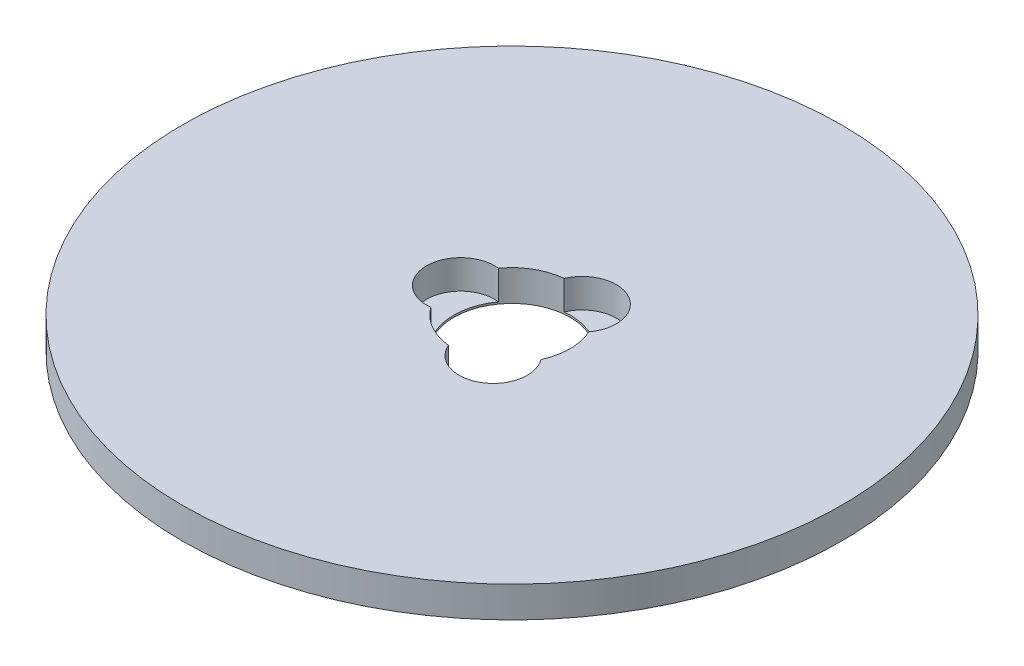
ISO-10303-21;
HEADER;
FILE_DESCRIPTION(('STEP AP214'),'2;1');
FILE_NAME('part.step','',(''),(''),'','','');
FILE_SCHEMA(('AUTOMOTIVE_DESIGN { 1 0 10303 214 1 1 1 1 }'));
ENDSEC;
DATA;
#1=APPLICATION_CONTEXT('core data for automotive mechanical design processes');
#2=APPLICATION_PROTOCOL_DEFINITION('international standard','automotive_design',2000,#1);
#3=PRODUCT_CONTEXT('',#1,'mechanical');
#4=PRODUCT('Part','Part','',(#3));
#5=PRODUCT_RELATED_PRODUCT_CATEGORY('part','',(#4));
#6=PRODUCT_DEFINITION_FORMATION('','',#4);
#7=PRODUCT_DEFINITION_CONTEXT('part definition',#1,'design');
#8=PRODUCT_DEFINITION('design','',#6,#7);
#9=PRODUCT_DEFINITION_SHAPE('','',#8);
#10=(LENGTH_UNIT() NAMED_UNIT(*) SI_UNIT(.MILLI.,.METRE.));
#11=(NAMED_UNIT(*) PLANE_ANGLE_UNIT() SI_UNIT($,.RADIAN.));
#12=(NAMED_UNIT(*) SI_UNIT($,.STERADIAN.) SOLID_ANGLE_UNIT());
#13=UNCERTAINTY_MEASURE_WITH_UNIT(LENGTH_MEASURE(1.E-05),#10,'distance_accuracy_value','');
#14=(GEOMETRIC_REPRESENTATION_CONTEXT(3) GLOBAL_UNCERTAINTY_ASSIGNED_CONTEXT((#13)) GLOBAL_UNIT_ASSIGNED_CONTEXT((#10,
#11,#12)) REPRESENTATION_CONTEXT('',''));
#15=CARTESIAN_POINT('',(0.,0.,0.));
#16=DIRECTION('',(0.,0.,1.));
#17=DIRECTION('',(1.,0.,0.));
#18=AXIS2_PLACEMENT_3D('',#15,#16,#17);
#19=CARTESIAN_POINT('',(0.,8.,0.));
#20=DIRECTION('',(0.,-1.,0.));
#21=DIRECTION('',(0.,0.,-1.));
#22=AXIS2_PLACEMENT_3D('',#19,#20,#21);
#23=CYLINDRICAL_SURFACE('',#22,85.);
#24=CARTESIAN_POINT('',(0.,8.,0.));
#25=DIRECTION('',(0.,1.,0.));
#26=DIRECTION('',(0.,0.,1.));
#27=AXIS2_PLACEMENT_3D('',#24,#25,#26);
#28=CIRCLE('',#27,85.);
#29=CARTESIAN_POINT('',(0.,8.,85.));
#30=VERTEX_POINT('',#29);
#31=EDGE_CURVE('E126',#30,#30,#28,.T.);
#32=ORIENTED_EDGE('',*,*,#31,.F.);
#33=EDGE_LOOP('',(#32));
#34=FACE_BOUND('',#33,.T.);
#35=CARTESIAN_POINT('',(0.,0.,0.));
#36=DIRECTION('',(0.,1.,0.));
#37=DIRECTION('',(0.,0.,1.));
#38=AXIS2_PLACEMENT_3D('',#35,#36,#37);
#39=CIRCLE('',#38,85.);
#40=CARTESIAN_POINT('',(0.,0.,85.));
#41=VERTEX_POINT('',#40);
#42=EDGE_CURVE('E124',#41,#41,#39,.T.);
#43=ORIENTED_EDGE('',*,*,#42,.T.);
#44=EDGE_LOOP('',(#43));
#45=FACE_BOUND('',#44,.T.);
#46=ADVANCED_FACE('F39',(#34,#45),#23,.T.);
#47=CARTESIAN_POINT('',(0.,8.,0.));
#48=DIRECTION('',(0.,1.,0.));
#49=DIRECTION('',(0.,0.,1.));
#50=AXIS2_PLACEMENT_3D('',#47,#48,#49);
#51=PLANE('',#50);
#52=CARTESIAN_POINT('',(6.62741142139258,8.,11.4790133045141));
#53=DIRECTION('',(0.,1.,0.));
#54=DIRECTION('',(0.866025403784436,0.,-0.500000000000004));
#55=AXIS2_PLACEMENT_3D('',#52,#53,#54);
#56=CIRCLE('',#55,8.78900368860901);
#57=CARTESIAN_POINT('',(-1.45609530379274,8.,14.9291589336531));
#58=VERTEX_POINT('',#57);
#59=CARTESIAN_POINT('',(13.6570785455754,8.,6.20356394341067));
#60=VERTEX_POINT('',#59);
#61=EDGE_CURVE('E147',#58,#60,#56,.T.);
#62=ORIENTED_EDGE('',*,*,#61,.F.);
#63=CARTESIAN_POINT('',(0.,8.,0.));
#64=DIRECTION('',(0.,1.,0.));
#65=DIRECTION('',(0.,0.,1.));
#66=AXIS2_PLACEMENT_3D('',#63,#64,#65);
#67=CIRCLE('',#66,15.);
#68=CARTESIAN_POINT('',(-12.2009832417825,8.,8.72559499024231));
#69=VERTEX_POINT('',#68);
#70=EDGE_CURVE('E118',#69,#58,#67,.T.);
#71=ORIENTED_EDGE('',*,*,#70,.F.);
#72=CARTESIAN_POINT('',(-13.254822842785,8.,0.));
#73=DIRECTION('',(0.,1.,0.));
#74=DIRECTION('',(0.,0.,1.));
#75=AXIS2_PLACEMENT_3D('',#72,#73,#74);
#76=CIRCLE('',#75,8.78900368860901);
#77=CARTESIAN_POINT('',(-12.2009832417825,8.,-8.72559499024231));
#78=VERTEX_POINT('',#77);
#79=EDGE_CURVE('E113',#78,#69,#76,.T.);
#80=ORIENTED_EDGE('',*,*,#79,.F.);
#81=CARTESIAN_POINT('',(-1.45609530379294,8.,-14.929158933653));
#82=VERTEX_POINT('',#81);
#83=EDGE_CURVE('E106',#82,#78,#67,.T.);
#84=ORIENTED_EDGE('',*,*,#83,.F.);
#85=CARTESIAN_POINT('',(6.62741142139242,8.,-11.4790133045142));
#86=DIRECTION('',(0.,1.,0.));
#87=DIRECTION('',(-0.866025403784443,0.,-0.499999999999992));
#88=AXIS2_PLACEMENT_3D('',#85,#86,#87);
#89=CIRCLE('',#88,8.78900368860901);
#90=CARTESIAN_POINT('',(13.6570785455753,8.,-6.20356394341086));
#91=VERTEX_POINT('',#90);
#92=EDGE_CURVE('E90',#91,#82,#89,.T.);
#93=ORIENTED_EDGE('',*,*,#92,.F.);
#94=EDGE_CURVE('E116',#60,#91,#67,.T.);
#95=ORIENTED_EDGE('',*,*,#94,.F.);
#96=EDGE_LOOP('',(#62,#71,#80,#84,#93,#95));
#97=FACE_BOUND('',#96,.T.);
#98=ORIENTED_EDGE('',*,*,#31,.T.);
#99=EDGE_LOOP('',(#98));
#100=FACE_BOUND('',#99,.T.);
#101=ADVANCED_FACE('F115',(#97,#100),#51,.T.);
#102=CARTESIAN_POINT('',(0.,0.,0.));
#103=DIRECTION('',(0.,1.,0.));
#104=DIRECTION('',(0.,0.,1.));
#105=AXIS2_PLACEMENT_3D('',#102,#103,#104);
#106=PLANE('',#105);
#107=CARTESIAN_POINT('',(0.,0.,0.));
#108=DIRECTION('',(0.,1.,0.));
#109=DIRECTION('',(0.,0.,1.));
#110=AXIS2_PLACEMENT_3D('',#107,#108,#109);
#111=CIRCLE('',#110,15.);
#112=CARTESIAN_POINT('',(0.,0.,15.));
#113=VERTEX_POINT('',#112);
#114=EDGE_CURVE('E120',#113,#113,#111,.T.);
#115=ORIENTED_EDGE('',*,*,#114,.T.);
#116=EDGE_LOOP('',(#115));
#117=FACE_BOUND('',#116,.T.);
#118=ORIENTED_EDGE('',*,*,#42,.F.);
#119=EDGE_LOOP('',(#118));
#120=FACE_BOUND('',#119,.T.);
#121=ADVANCED_FACE('F164',(#117,#120),#106,.F.);
#122=CARTESIAN_POINT('',(0.,8.,0.));
#123=DIRECTION('',(0.,-1.,0.));
#124=DIRECTION('',(0.,0.,-1.));
#125=AXIS2_PLACEMENT_3D('',#122,#123,#124);
#126=CYLINDRICAL_SURFACE('',#125,15.);
#127=DIRECTION('',(0.,1.,0.));
#128=VECTOR('',#127,1.);
#129=CARTESIAN_POINT('',(-1.45609530379274,4.25376474505026,14.9291589336531));
#130=LINE('',#129,#128);
#131=CARTESIAN_POINT('',(-1.45609530379274,0.507529490100521,14.9291589336531));
#132=VERTEX_POINT('',#131);
#133=EDGE_CURVE('E11',#132,#58,#130,.T.);
#134=ORIENTED_EDGE('',*,*,#133,.F.);
#135=CARTESIAN_POINT('',(0.,0.507529490100521,0.));
#136=DIRECTION('',(0.,1.,0.));
#137=DIRECTION('',(0.,0.,1.));
#138=AXIS2_PLACEMENT_3D('',#135,#136,#137);
#139=CIRCLE('',#138,15.);
#140=CARTESIAN_POINT('',(13.6570785455754,0.507529490100521,6.20356394341067));
#141=VERTEX_POINT('',#140);
#142=EDGE_CURVE('E144',#132,#141,#139,.T.);
#143=ORIENTED_EDGE('',*,*,#142,.T.);
#144=DIRECTION('',(0.,1.,0.));
#145=VECTOR('',#144,1.);
#146=CARTESIAN_POINT('',(13.6570785455754,4.25376474505026,6.20356394341067));
#147=LINE('',#146,#145);
#148=EDGE_CURVE('E46',#60,#141,#147,.F.);
#149=ORIENTED_EDGE('',*,*,#148,.F.);
#150=ORIENTED_EDGE('',*,*,#94,.T.);
#151=DIRECTION('',(0.,1.,0.));
#152=VECTOR('',#151,1.);
#153=CARTESIAN_POINT('',(13.6570785455753,4.25376474505026,-6.20356394341086));
#154=LINE('',#153,#152);
#155=CARTESIAN_POINT('',(13.6570785455753,0.507529490100521,-6.20356394341086));
#156=VERTEX_POINT('',#155);
#157=EDGE_CURVE('E92',#156,#91,#154,.T.);
#158=ORIENTED_EDGE('',*,*,#157,.F.);
#159=CARTESIAN_POINT('',(0.,0.507529490100521,0.));
#160=DIRECTION('',(0.,1.,0.));
#161=DIRECTION('',(0.,0.,1.));
#162=AXIS2_PLACEMENT_3D('',#159,#160,#161);
#163=CIRCLE('',#162,15.);
#164=CARTESIAN_POINT('',(-1.45609530379294,0.507529490100521,-14.929158933653));
#165=VERTEX_POINT('',#164);
#166=EDGE_CURVE('E107',#156,#165,#163,.T.);
#167=ORIENTED_EDGE('',*,*,#166,.T.);
#168=DIRECTION('',(0.,1.,0.));
#169=VECTOR('',#168,1.);
#170=CARTESIAN_POINT('',(-1.45609530379294,4.25376474505026,-14.929158933653));
#171=LINE('',#170,#169);
#172=EDGE_CURVE('E95',#82,#165,#171,.F.);
#173=ORIENTED_EDGE('',*,*,#172,.F.);
#174=ORIENTED_EDGE('',*,*,#83,.T.);
#175=DIRECTION('',(0.,1.,0.));
#176=VECTOR('',#175,1.);
#177=CARTESIAN_POINT('',(-12.2009832417825,4.25376474505026,-8.72559499024231));
#178=LINE('',#177,#176);
#179=CARTESIAN_POINT('',(-12.2009832417825,0.507529490100521,-8.72559499024231));
#180=VERTEX_POINT('',#179);
#181=EDGE_CURVE('E143',#180,#78,#178,.T.);
#182=ORIENTED_EDGE('',*,*,#181,.F.);
#183=CARTESIAN_POINT('',(0.,0.507529490100521,0.));
#184=DIRECTION('',(0.,1.,0.));
#185=DIRECTION('',(0.,0.,1.));
#186=AXIS2_PLACEMENT_3D('',#183,#184,#185);
#187=CIRCLE('',#186,15.);
#188=CARTESIAN_POINT('',(-12.2009832417825,0.507529490100521,8.72559499024231));
#189=VERTEX_POINT('',#188);
#190=EDGE_CURVE('E132',#180,#189,#187,.T.);
#191=ORIENTED_EDGE('',*,*,#190,.T.);
#192=DIRECTION('',(0.,1.,0.));
#193=VECTOR('',#192,1.);
#194=CARTESIAN_POINT('',(-12.2009832417825,4.25376474505026,8.72559499024231));
#195=LINE('',#194,#193);
#196=EDGE_CURVE('E137',#69,#189,#195,.F.);
#197=ORIENTED_EDGE('',*,*,#196,.F.);
#198=ORIENTED_EDGE('',*,*,#70,.T.);
#199=EDGE_LOOP('',(#134,#143,#149,#150,#158,#167,#173,#174,#182,#191,#197,#198));
#200=FACE_BOUND('',#199,.T.);
#201=ORIENTED_EDGE('',*,*,#114,.F.);
#202=EDGE_LOOP('',(#201));
#203=FACE_BOUND('',#202,.T.);
#204=ADVANCED_FACE('F103',(#200,#203),#126,.F.);
#205=CARTESIAN_POINT('',(-13.254822842785,0.507529490100521,0.));
#206=DIRECTION('',(0.,1.,0.));
#207=DIRECTION('',(0.,0.,1.));
#208=AXIS2_PLACEMENT_3D('',#205,#206,#207);
#209=CYLINDRICAL_SURFACE('',#208,8.78900368860901);
#210=ORIENTED_EDGE('',*,*,#181,.T.);
#211=ORIENTED_EDGE('',*,*,#79,.T.);
#212=ORIENTED_EDGE('',*,*,#196,.T.);
#213=CARTESIAN_POINT('',(-13.254822842785,0.507529490100521,0.));
#214=DIRECTION('',(0.,1.,0.));
#215=DIRECTION('',(0.,0.,1.));
#216=AXIS2_PLACEMENT_3D('',#213,#214,#215);
#217=CIRCLE('',#216,8.78900368860901);
#218=EDGE_CURVE('E121',#180,#189,#217,.T.);
#219=ORIENTED_EDGE('',*,*,#218,.F.);
#220=EDGE_LOOP('',(#210,#211,#212,#219));
#221=FACE_BOUND('',#220,.T.);
#222=ADVANCED_FACE('F174',(#221),#209,.F.);
#223=CARTESIAN_POINT('',(-13.254822842785,0.507529490100521,0.));
#224=DIRECTION('',(0.,1.,0.));
#225=DIRECTION('',(0.,0.,1.));
#226=AXIS2_PLACEMENT_3D('',#223,#224,#225);
#227=PLANE('',#226);
#228=ORIENTED_EDGE('',*,*,#218,.T.);
#229=ORIENTED_EDGE('',*,*,#190,.F.);
#230=EDGE_LOOP('',(#228,#229));
#231=FACE_BOUND('',#230,.T.);
#232=ADVANCED_FACE('F177',(#231),#227,.T.);
#233=CARTESIAN_POINT('',(6.62741142139242,0.507529490100521,-11.4790133045142));
#234=DIRECTION('',(0.,1.,0.));
#235=DIRECTION('',(0.,0.,1.));
#236=AXIS2_PLACEMENT_3D('',#233,#234,#235);
#237=CYLINDRICAL_SURFACE('',#236,8.78900368860901);
#238=ORIENTED_EDGE('',*,*,#157,.T.);
#239=ORIENTED_EDGE('',*,*,#92,.T.);
#240=ORIENTED_EDGE('',*,*,#172,.T.);
#241=CARTESIAN_POINT('',(6.62741142139242,0.507529490100521,-11.4790133045142));
#242=DIRECTION('',(0.,1.,0.));
#243=DIRECTION('',(-0.866025403784443,0.,-0.499999999999992));
#244=AXIS2_PLACEMENT_3D('',#241,#242,#243);
#245=CIRCLE('',#244,8.78900368860901);
#246=EDGE_CURVE('E56',#156,#165,#245,.T.);
#247=ORIENTED_EDGE('',*,*,#246,.F.);
#248=EDGE_LOOP('',(#238,#239,#240,#247));
#249=FACE_BOUND('',#248,.T.);
#250=ADVANCED_FACE('F93',(#249),#237,.F.);
#251=CARTESIAN_POINT('',(6.62741142139242,0.507529490100521,-11.4790133045142));
#252=DIRECTION('',(0.,1.,0.));
#253=DIRECTION('',(-0.866025403784443,0.,-0.499999999999992));
#254=AXIS2_PLACEMENT_3D('',#251,#252,#253);
#255=PLANE('',#254);
#256=ORIENTED_EDGE('',*,*,#246,.T.);
#257=ORIENTED_EDGE('',*,*,#166,.F.);
#258=EDGE_LOOP('',(#256,#257));
#259=FACE_BOUND('',#258,.T.);
#260=ADVANCED_FACE('F160',(#259),#255,.T.);
#261=CARTESIAN_POINT('',(6.62741142139258,0.507529490100521,11.4790133045141));
#262=DIRECTION('',(0.,1.,0.));
#263=DIRECTION('',(0.,0.,1.));
#264=AXIS2_PLACEMENT_3D('',#261,#262,#263);
#265=CYLINDRICAL_SURFACE('',#264,8.78900368860901);
#266=ORIENTED_EDGE('',*,*,#133,.T.);
#267=ORIENTED_EDGE('',*,*,#61,.T.);
#268=ORIENTED_EDGE('',*,*,#148,.T.);
#269=CARTESIAN_POINT('',(6.62741142139258,0.507529490100521,11.4790133045141));
#270=DIRECTION('',(0.,1.,0.));
#271=DIRECTION('',(0.866025403784436,0.,-0.500000000000004));
#272=AXIS2_PLACEMENT_3D('',#269,#270,#271);
#273=CIRCLE('',#272,8.78900368860901);
#274=EDGE_CURVE('E55',#132,#141,#273,.T.);
#275=ORIENTED_EDGE('',*,*,#274,.F.);
#276=EDGE_LOOP('',(#266,#267,#268,#275));
#277=FACE_BOUND('',#276,.T.);
#278=ADVANCED_FACE('F149',(#277),#265,.F.);
#279=CARTESIAN_POINT('',(6.62741142139258,0.507529490100521,11.4790133045141));
#280=DIRECTION('',(0.,1.,0.));
#281=DIRECTION('',(0.866025403784436,0.,-0.500000000000004));
#282=AXIS2_PLACEMENT_3D('',#279,#280,#281);
#283=PLANE('',#282);
#284=ORIENTED_EDGE('',*,*,#274,.T.);
#285=ORIENTED_EDGE('',*,*,#142,.F.);
#286=EDGE_LOOP('',(#284,#285));
#287=FACE_BOUND('',#286,.T.);
#288=ADVANCED_FACE('F151',(#287),#283,.T.);
#289=CLOSED_SHELL('',(#46,#101,#121,#204,#222,#232,#250,#260,#278,#288));
#290=MANIFOLD_SOLID_BREP('B2',#289);
#291=ADVANCED_BREP_SHAPE_REPRESENTATION('',(#18,#290),#14);
#292=SHAPE_DEFINITION_REPRESENTATION(#9,#291);
ENDSEC;
END-ISO-10303-21;
